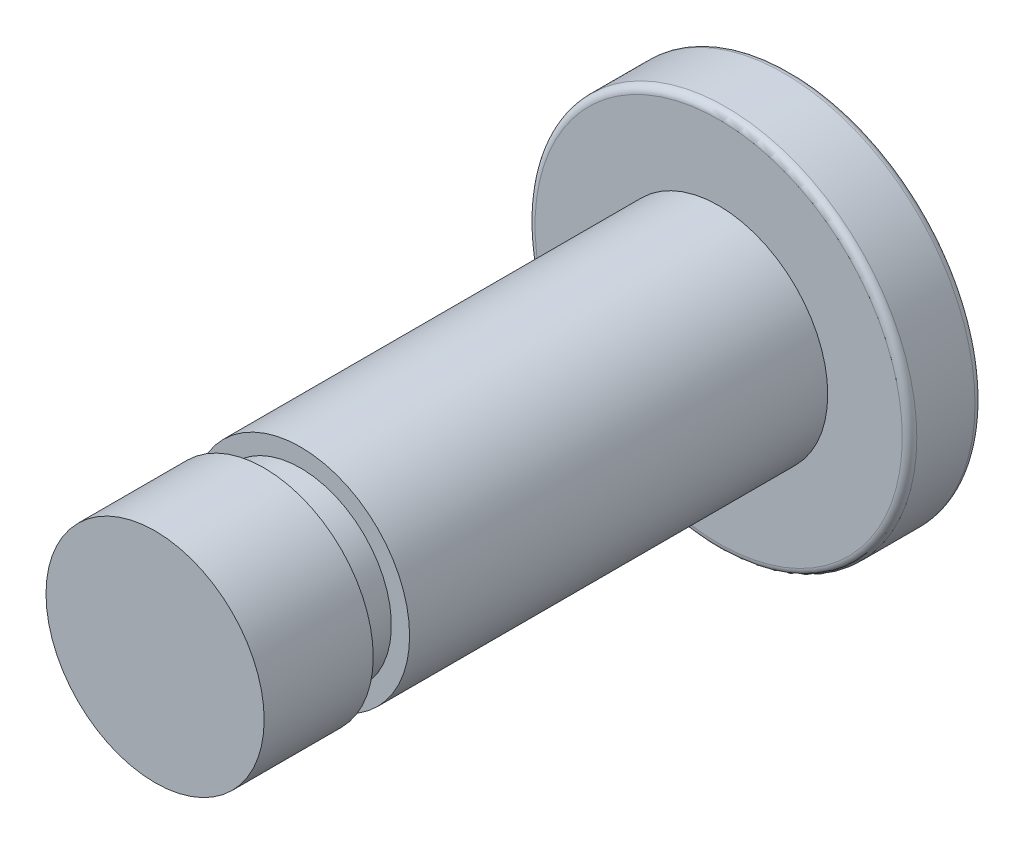
ISO-10303-21;
HEADER;
FILE_DESCRIPTION(('STEP AP214'),'2;1');
FILE_NAME('part.step','',(''),(''),'','','');
FILE_SCHEMA(('AUTOMOTIVE_DESIGN { 1 0 10303 214 1 1 1 1 }'));
ENDSEC;
DATA;
#1=APPLICATION_CONTEXT('core data for automotive mechanical design processes');
#2=APPLICATION_PROTOCOL_DEFINITION('international standard','automotive_design',2000,#1);
#3=PRODUCT_CONTEXT('',#1,'mechanical');
#4=PRODUCT('Part','Part','',(#3));
#5=PRODUCT_RELATED_PRODUCT_CATEGORY('part','',(#4));
#6=PRODUCT_DEFINITION_FORMATION('','',#4);
#7=PRODUCT_DEFINITION_CONTEXT('part definition',#1,'design');
#8=PRODUCT_DEFINITION('design','',#6,#7);
#9=PRODUCT_DEFINITION_SHAPE('','',#8);
#10=(LENGTH_UNIT() NAMED_UNIT(*) SI_UNIT(.MILLI.,.METRE.));
#11=(NAMED_UNIT(*) PLANE_ANGLE_UNIT() SI_UNIT($,.RADIAN.));
#12=(NAMED_UNIT(*) SI_UNIT($,.STERADIAN.) SOLID_ANGLE_UNIT());
#13=UNCERTAINTY_MEASURE_WITH_UNIT(LENGTH_MEASURE(1.E-05),#10,'distance_accuracy_value','');
#14=(GEOMETRIC_REPRESENTATION_CONTEXT(3) GLOBAL_UNCERTAINTY_ASSIGNED_CONTEXT((#13)) GLOBAL_UNIT_ASSIGNED_CONTEXT((#10,
#11,#12)) REPRESENTATION_CONTEXT('',''));
#15=CARTESIAN_POINT('',(0.,0.,0.));
#16=DIRECTION('',(0.,0.,1.));
#17=DIRECTION('',(1.,0.,0.));
#18=AXIS2_PLACEMENT_3D('',#15,#16,#17);
#19=CARTESIAN_POINT('',(3.,0.,0.));
#20=DIRECTION('',(0.,0.,1.));
#21=DIRECTION('',(1.,0.,0.));
#22=AXIS2_PLACEMENT_3D('',#19,#20,#21);
#23=PLANE('',#22);
#24=CARTESIAN_POINT('',(3.,0.,0.));
#25=DIRECTION('',(0.,0.,-1.));
#26=DIRECTION('',(-1.,0.,0.));
#27=AXIS2_PLACEMENT_3D('',#24,#25,#26);
#28=CIRCLE('',#27,3.);
#29=CARTESIAN_POINT('',(0.,0.,0.));
#30=VERTEX_POINT('',#29);
#31=EDGE_CURVE('E50',#30,#30,#28,.T.);
#32=ORIENTED_EDGE('',*,*,#31,.F.);
#33=EDGE_LOOP('',(#32));
#34=FACE_BOUND('',#33,.T.);
#35=ADVANCED_FACE('F30',(#34),#23,.T.);
#36=CARTESIAN_POINT('',(3.,0.,-17.5));
#37=DIRECTION('',(0.,0.,-1.));
#38=DIRECTION('',(-1.,0.,0.));
#39=AXIS2_PLACEMENT_3D('',#36,#37,#38);
#40=CYLINDRICAL_SURFACE('',#39,3.);
#41=ORIENTED_EDGE('',*,*,#31,.T.);
#42=EDGE_LOOP('',(#41));
#43=FACE_BOUND('',#42,.T.);
#44=CARTESIAN_POINT('',(3.,0.,-3.));
#45=DIRECTION('',(0.,0.,-1.));
#46=DIRECTION('',(-1.,0.,0.));
#47=AXIS2_PLACEMENT_3D('',#44,#45,#46);
#48=CIRCLE('',#47,3.);
#49=CARTESIAN_POINT('',(0.,0.,-3.));
#50=VERTEX_POINT('',#49);
#51=EDGE_CURVE('E53',#50,#50,#48,.T.);
#52=ORIENTED_EDGE('',*,*,#51,.F.);
#53=EDGE_LOOP('',(#52));
#54=FACE_BOUND('',#53,.T.);
#55=ADVANCED_FACE('F86',(#43,#54),#40,.T.);
#56=CARTESIAN_POINT('',(0.5,0.,-3.));
#57=DIRECTION('',(0.,0.,-1.));
#58=DIRECTION('',(-1.,0.,0.));
#59=AXIS2_PLACEMENT_3D('',#56,#57,#58);
#60=PLANE('',#59);
#61=ORIENTED_EDGE('',*,*,#51,.T.);
#62=EDGE_LOOP('',(#61));
#63=FACE_BOUND('',#62,.T.);
#64=CARTESIAN_POINT('',(3.,0.,-3.));
#65=DIRECTION('',(0.,0.,-1.));
#66=DIRECTION('',(-1.,0.,0.));
#67=AXIS2_PLACEMENT_3D('',#64,#65,#66);
#68=CIRCLE('',#67,2.5);
#69=CARTESIAN_POINT('',(0.5,0.,-3.));
#70=VERTEX_POINT('',#69);
#71=EDGE_CURVE('E56',#70,#70,#68,.T.);
#72=ORIENTED_EDGE('',*,*,#71,.F.);
#73=EDGE_LOOP('',(#72));
#74=FACE_BOUND('',#73,.T.);
#75=ADVANCED_FACE('F92',(#63,#74),#60,.T.);
#76=CARTESIAN_POINT('',(3.,0.,-17.5));
#77=DIRECTION('',(0.,0.,-1.));
#78=DIRECTION('',(-1.,0.,0.));
#79=AXIS2_PLACEMENT_3D('',#76,#77,#78);
#80=CYLINDRICAL_SURFACE('',#79,2.5);
#81=ORIENTED_EDGE('',*,*,#71,.T.);
#82=EDGE_LOOP('',(#81));
#83=FACE_BOUND('',#82,.T.);
#84=CARTESIAN_POINT('',(3.,0.,-4.));
#85=DIRECTION('',(0.,0.,-1.));
#86=DIRECTION('',(-1.,0.,0.));
#87=AXIS2_PLACEMENT_3D('',#84,#85,#86);
#88=CIRCLE('',#87,2.5);
#89=CARTESIAN_POINT('',(0.5,0.,-4.));
#90=VERTEX_POINT('',#89);
#91=EDGE_CURVE('E59',#90,#90,#88,.T.);
#92=ORIENTED_EDGE('',*,*,#91,.F.);
#93=EDGE_LOOP('',(#92));
#94=FACE_BOUND('',#93,.T.);
#95=ADVANCED_FACE('F82',(#83,#94),#80,.T.);
#96=CARTESIAN_POINT('',(0.,0.,-4.));
#97=DIRECTION('',(0.,0.,1.));
#98=DIRECTION('',(1.,0.,0.));
#99=AXIS2_PLACEMENT_3D('',#96,#97,#98);
#100=PLANE('',#99);
#101=ORIENTED_EDGE('',*,*,#91,.T.);
#102=EDGE_LOOP('',(#101));
#103=FACE_BOUND('',#102,.T.);
#104=CARTESIAN_POINT('',(3.,0.,-4.));
#105=DIRECTION('',(0.,0.,-1.));
#106=DIRECTION('',(-1.,0.,0.));
#107=AXIS2_PLACEMENT_3D('',#104,#105,#106);
#108=CIRCLE('',#107,3.);
#109=CARTESIAN_POINT('',(0.,0.,-4.));
#110=VERTEX_POINT('',#109);
#111=EDGE_CURVE('E62',#110,#110,#108,.T.);
#112=ORIENTED_EDGE('',*,*,#111,.F.);
#113=EDGE_LOOP('',(#112));
#114=FACE_BOUND('',#113,.T.);
#115=ADVANCED_FACE('F73',(#103,#114),#100,.T.);
#116=CARTESIAN_POINT('',(3.,0.,-17.5));
#117=DIRECTION('',(0.,0.,-1.));
#118=DIRECTION('',(-1.,0.,0.));
#119=AXIS2_PLACEMENT_3D('',#116,#117,#118);
#120=CYLINDRICAL_SURFACE('',#119,3.);
#121=ORIENTED_EDGE('',*,*,#111,.T.);
#122=EDGE_LOOP('',(#121));
#123=FACE_BOUND('',#122,.T.);
#124=CARTESIAN_POINT('',(3.,0.,-15.5));
#125=DIRECTION('',(0.,0.,-1.));
#126=DIRECTION('',(-1.,0.,0.));
#127=AXIS2_PLACEMENT_3D('',#124,#125,#126);
#128=CIRCLE('',#127,3.);
#129=CARTESIAN_POINT('',(0.,0.,-15.5));
#130=VERTEX_POINT('',#129);
#131=EDGE_CURVE('E65',#130,#130,#128,.T.);
#132=ORIENTED_EDGE('',*,*,#131,.F.);
#133=EDGE_LOOP('',(#132));
#134=FACE_BOUND('',#133,.T.);
#135=ADVANCED_FACE('F71',(#123,#134),#120,.T.);
#136=CARTESIAN_POINT('',(0.,0.,-15.5));
#137=DIRECTION('',(0.,0.,1.));
#138=DIRECTION('',(1.,0.,0.));
#139=AXIS2_PLACEMENT_3D('',#136,#137,#138);
#140=PLANE('',#139);
#141=CARTESIAN_POINT('',(3.,0.,-15.5));
#142=DIRECTION('',(0.,0.,1.));
#143=DIRECTION('',(1.,0.,0.));
#144=AXIS2_PLACEMENT_3D('',#141,#142,#143);
#145=CIRCLE('',#144,5.05);
#146=CARTESIAN_POINT('',(8.05,0.,-15.5));
#147=VERTEX_POINT('',#146);
#148=EDGE_CURVE('E37',#147,#147,#145,.T.);
#149=ORIENTED_EDGE('',*,*,#148,.T.);
#150=EDGE_LOOP('',(#149));
#151=FACE_BOUND('',#150,.T.);
#152=ORIENTED_EDGE('',*,*,#131,.T.);
#153=EDGE_LOOP('',(#152));
#154=FACE_BOUND('',#153,.T.);
#155=ADVANCED_FACE('F69',(#151,#154),#140,.T.);
#156=CARTESIAN_POINT('',(3.,0.,-17.5));
#157=DIRECTION('',(0.,0.,-1.));
#158=DIRECTION('',(-1.,0.,0.));
#159=AXIS2_PLACEMENT_3D('',#156,#157,#158);
#160=CYLINDRICAL_SURFACE('',#159,5.25);
#161=CARTESIAN_POINT('',(3.,0.,-15.7));
#162=DIRECTION('',(0.,0.,1.));
#163=DIRECTION('',(1.,0.,0.));
#164=AXIS2_PLACEMENT_3D('',#161,#162,#163);
#165=CIRCLE('',#164,5.25);
#166=CARTESIAN_POINT('',(8.25,0.,-15.7));
#167=VERTEX_POINT('',#166);
#168=EDGE_CURVE('E41',#167,#167,#165,.F.);
#169=ORIENTED_EDGE('',*,*,#168,.T.);
#170=EDGE_LOOP('',(#169));
#171=FACE_BOUND('',#170,.T.);
#172=CARTESIAN_POINT('',(3.,0.,-17.3));
#173=DIRECTION('',(0.,0.,-1.));
#174=DIRECTION('',(-1.,0.,0.));
#175=AXIS2_PLACEMENT_3D('',#172,#173,#174);
#176=CIRCLE('',#175,5.25);
#177=CARTESIAN_POINT('',(-2.25,0.,-17.3));
#178=VERTEX_POINT('',#177);
#179=EDGE_CURVE('E45',#178,#178,#176,.F.);
#180=ORIENTED_EDGE('',*,*,#179,.T.);
#181=EDGE_LOOP('',(#180));
#182=FACE_BOUND('',#181,.T.);
#183=ADVANCED_FACE('F80',(#171,#182),#160,.T.);
#184=CARTESIAN_POINT('',(-2.25,0.,-17.5));
#185=DIRECTION('',(0.,0.,-1.));
#186=DIRECTION('',(-1.,0.,0.));
#187=AXIS2_PLACEMENT_3D('',#184,#185,#186);
#188=PLANE('',#187);
#189=CARTESIAN_POINT('',(3.,0.,-17.5));
#190=DIRECTION('',(0.,0.,-1.));
#191=DIRECTION('',(-1.,0.,0.));
#192=AXIS2_PLACEMENT_3D('',#189,#190,#191);
#193=CIRCLE('',#192,5.05);
#194=CARTESIAN_POINT('',(-2.05,0.,-17.5));
#195=VERTEX_POINT('',#194);
#196=EDGE_CURVE('E10',#195,#195,#193,.T.);
#197=ORIENTED_EDGE('',*,*,#196,.T.);
#198=EDGE_LOOP('',(#197));
#199=FACE_BOUND('',#198,.T.);
#200=ADVANCED_FACE('F99',(#199),#188,.T.);
#201=CARTESIAN_POINT('',(3.,0.,-15.7));
#202=DIRECTION('',(0.,0.,1.));
#203=DIRECTION('',(1.,0.,0.));
#204=AXIS2_PLACEMENT_3D('',#201,#202,#203);
#205=TOROIDAL_SURFACE('',#204,5.05,0.2);
#206=ORIENTED_EDGE('',*,*,#148,.F.);
#207=EDGE_LOOP('',(#206));
#208=FACE_BOUND('',#207,.T.);
#209=ORIENTED_EDGE('',*,*,#168,.F.);
#210=EDGE_LOOP('',(#209));
#211=FACE_BOUND('',#210,.T.);
#212=ADVANCED_FACE('F97',(#208,#211),#205,.T.);
#213=CARTESIAN_POINT('',(3.,0.,-17.3));
#214=DIRECTION('',(0.,0.,-1.));
#215=DIRECTION('',(-1.,0.,0.));
#216=AXIS2_PLACEMENT_3D('',#213,#214,#215);
#217=TOROIDAL_SURFACE('',#216,5.05,0.2);
#218=ORIENTED_EDGE('',*,*,#179,.F.);
#219=EDGE_LOOP('',(#218));
#220=FACE_BOUND('',#219,.T.);
#221=ORIENTED_EDGE('',*,*,#196,.F.);
#222=EDGE_LOOP('',(#221));
#223=FACE_BOUND('',#222,.T.);
#224=ADVANCED_FACE('F32',(#220,#223),#217,.T.);
#225=CLOSED_SHELL('',(#35,#55,#75,#95,#115,#135,#155,#183,#200,#212,#224));
#226=MANIFOLD_SOLID_BREP('B2',#225);
#227=ADVANCED_BREP_SHAPE_REPRESENTATION('',(#18,#226),#14);
#228=SHAPE_DEFINITION_REPRESENTATION(#9,#227);
ENDSEC;
END-ISO-10303-21;
